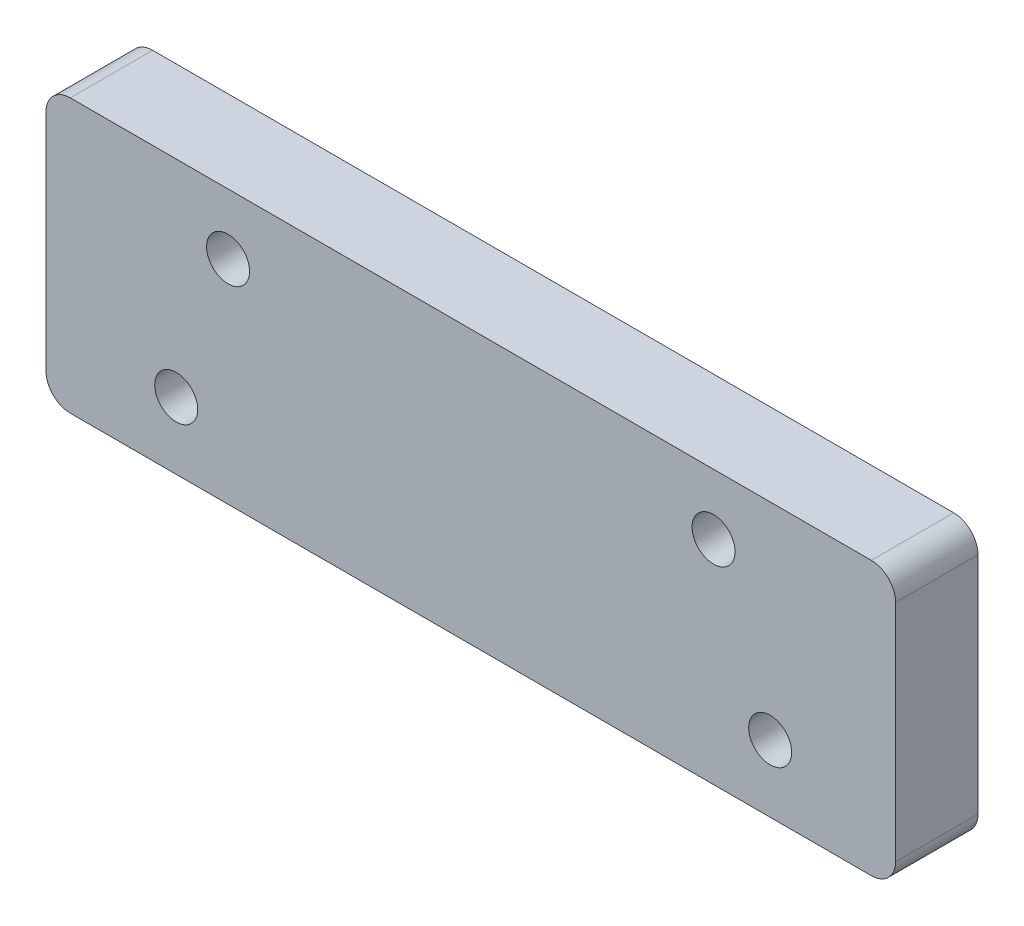
ISO-10303-21;
HEADER;
FILE_DESCRIPTION(('STEP AP214'),'2;1');
FILE_NAME('part.step','',(''),(''),'','','');
FILE_SCHEMA(('AUTOMOTIVE_DESIGN { 1 0 10303 214 1 1 1 1 }'));
ENDSEC;
DATA;
#1=APPLICATION_CONTEXT('core data for automotive mechanical design processes');
#2=APPLICATION_PROTOCOL_DEFINITION('international standard','automotive_design',2000,#1);
#3=PRODUCT_CONTEXT('',#1,'mechanical');
#4=PRODUCT('Part','Part','',(#3));
#5=PRODUCT_RELATED_PRODUCT_CATEGORY('part','',(#4));
#6=PRODUCT_DEFINITION_FORMATION('','',#4);
#7=PRODUCT_DEFINITION_CONTEXT('part definition',#1,'design');
#8=PRODUCT_DEFINITION('design','',#6,#7);
#9=PRODUCT_DEFINITION_SHAPE('','',#8);
#10=(LENGTH_UNIT() NAMED_UNIT(*) SI_UNIT(.MILLI.,.METRE.));
#11=(NAMED_UNIT(*) PLANE_ANGLE_UNIT() SI_UNIT($,.RADIAN.));
#12=(NAMED_UNIT(*) SI_UNIT($,.STERADIAN.) SOLID_ANGLE_UNIT());
#13=UNCERTAINTY_MEASURE_WITH_UNIT(LENGTH_MEASURE(1.E-05),#10,'distance_accuracy_value','');
#14=(GEOMETRIC_REPRESENTATION_CONTEXT(3) GLOBAL_UNCERTAINTY_ASSIGNED_CONTEXT((#13)) GLOBAL_UNIT_ASSIGNED_CONTEXT((#10,
#11,#12)) REPRESENTATION_CONTEXT('',''));
#15=CARTESIAN_POINT('',(0.,0.,0.));
#16=DIRECTION('',(0.,0.,1.));
#17=DIRECTION('',(1.,0.,0.));
#18=AXIS2_PLACEMENT_3D('',#15,#16,#17);
#19=CARTESIAN_POINT('',(17.45,15.875,-7.62));
#20=DIRECTION('',(-1.,0.,0.));
#21=DIRECTION('',(0.,-1.,0.));
#22=AXIS2_PLACEMENT_3D('',#19,#20,#21);
#23=PLANE('',#22);
#24=DIRECTION('',(0.,1.,0.));
#25=VECTOR('',#24,1.);
#26=CARTESIAN_POINT('',(17.45,0.,-8.62));
#27=LINE('',#26,#25);
#28=CARTESIAN_POINT('',(17.45,2.53999999999999,-8.62));
#29=VERTEX_POINT('',#28);
#30=CARTESIAN_POINT('',(17.45,26.035,-8.62));
#31=VERTEX_POINT('',#30);
#32=EDGE_CURVE('E154',#29,#31,#27,.T.);
#33=ORIENTED_EDGE('',*,*,#32,.F.);
#34=DIRECTION('',(0.,0.,1.));
#35=VECTOR('',#34,1.);
#36=CARTESIAN_POINT('',(17.45,2.53999999999999,-7.62));
#37=LINE('',#36,#35);
#38=CARTESIAN_POINT('',(17.45,2.53999999999999,0.));
#39=VERTEX_POINT('',#38);
#40=EDGE_CURVE('E11',#29,#39,#37,.T.);
#41=ORIENTED_EDGE('',*,*,#40,.T.);
#42=DIRECTION('',(0.,-1.,0.));
#43=VECTOR('',#42,1.);
#44=CARTESIAN_POINT('',(17.45,15.875,0.));
#45=LINE('',#44,#43);
#46=CARTESIAN_POINT('',(17.45,26.035,0.));
#47=VERTEX_POINT('',#46);
#48=EDGE_CURVE('E183',#47,#39,#45,.T.);
#49=ORIENTED_EDGE('',*,*,#48,.F.);
#50=DIRECTION('',(0.,0.,1.));
#51=VECTOR('',#50,1.);
#52=CARTESIAN_POINT('',(17.45,26.035,-8.62));
#53=LINE('',#52,#51);
#54=EDGE_CURVE('E44',#47,#31,#53,.F.);
#55=ORIENTED_EDGE('',*,*,#54,.T.);
#56=EDGE_LOOP('',(#33,#41,#49,#55));
#57=FACE_BOUND('',#56,.T.);
#58=ADVANCED_FACE('F36',(#57),#23,.T.);
#59=CARTESIAN_POINT('',(106.35,15.875,-7.62));
#60=DIRECTION('',(1.,0.,0.));
#61=DIRECTION('',(0.,0.,-1.));
#62=AXIS2_PLACEMENT_3D('',#59,#60,#61);
#63=PLANE('',#62);
#64=DIRECTION('',(0.,-1.,0.));
#65=VECTOR('',#64,1.);
#66=CARTESIAN_POINT('',(106.35,15.875,-8.62));
#67=LINE('',#66,#65);
#68=CARTESIAN_POINT('',(106.35,26.035,-8.62));
#69=VERTEX_POINT('',#68);
#70=CARTESIAN_POINT('',(106.35,2.54,-8.62));
#71=VERTEX_POINT('',#70);
#72=EDGE_CURVE('E157',#69,#71,#67,.T.);
#73=ORIENTED_EDGE('',*,*,#72,.F.);
#74=DIRECTION('',(0.,0.,1.));
#75=VECTOR('',#74,1.);
#76=CARTESIAN_POINT('',(106.35,26.035,0.));
#77=LINE('',#76,#75);
#78=CARTESIAN_POINT('',(106.35,26.035,0.));
#79=VERTEX_POINT('',#78);
#80=EDGE_CURVE('E122',#69,#79,#77,.T.);
#81=ORIENTED_EDGE('',*,*,#80,.T.);
#82=DIRECTION('',(0.,1.,0.));
#83=VECTOR('',#82,1.);
#84=CARTESIAN_POINT('',(106.35,15.875,0.));
#85=LINE('',#84,#83);
#86=CARTESIAN_POINT('',(106.35,2.54,0.));
#87=VERTEX_POINT('',#86);
#88=EDGE_CURVE('E105',#87,#79,#85,.T.);
#89=ORIENTED_EDGE('',*,*,#88,.F.);
#90=DIRECTION('',(0.,0.,1.));
#91=VECTOR('',#90,1.);
#92=CARTESIAN_POINT('',(106.35,2.54,-7.62));
#93=LINE('',#92,#91);
#94=EDGE_CURVE('E119',#87,#71,#93,.F.);
#95=ORIENTED_EDGE('',*,*,#94,.T.);
#96=EDGE_LOOP('',(#73,#81,#89,#95));
#97=FACE_BOUND('',#96,.T.);
#98=ADVANCED_FACE('F118',(#97),#63,.T.);
#99=CARTESIAN_POINT('',(106.35,0.,-7.62));
#100=DIRECTION('',(0.,-1.,0.));
#101=DIRECTION('',(1.,0.,0.));
#102=AXIS2_PLACEMENT_3D('',#99,#100,#101);
#103=PLANE('',#102);
#104=DIRECTION('',(-1.,0.,0.));
#105=VECTOR('',#104,1.);
#106=CARTESIAN_POINT('',(106.35,0.,-8.62));
#107=LINE('',#106,#105);
#108=CARTESIAN_POINT('',(103.81,0.,-8.62));
#109=VERTEX_POINT('',#108);
#110=CARTESIAN_POINT('',(19.99,0.,-8.62));
#111=VERTEX_POINT('',#110);
#112=EDGE_CURVE('E153',#109,#111,#107,.T.);
#113=ORIENTED_EDGE('',*,*,#112,.F.);
#114=DIRECTION('',(0.,0.,1.));
#115=VECTOR('',#114,1.);
#116=CARTESIAN_POINT('',(103.81,0.,-7.62));
#117=LINE('',#116,#115);
#118=CARTESIAN_POINT('',(103.81,0.,0.));
#119=VERTEX_POINT('',#118);
#120=EDGE_CURVE('E148',#109,#119,#117,.T.);
#121=ORIENTED_EDGE('',*,*,#120,.T.);
#122=DIRECTION('',(1.,0.,0.));
#123=VECTOR('',#122,1.);
#124=CARTESIAN_POINT('',(106.35,0.,0.));
#125=LINE('',#124,#123);
#126=CARTESIAN_POINT('',(19.99,0.,0.));
#127=VERTEX_POINT('',#126);
#128=EDGE_CURVE('E107',#127,#119,#125,.T.);
#129=ORIENTED_EDGE('',*,*,#128,.F.);
#130=DIRECTION('',(0.,0.,1.));
#131=VECTOR('',#130,1.);
#132=CARTESIAN_POINT('',(19.99,0.,-7.62));
#133=LINE('',#132,#131);
#134=EDGE_CURVE('E146',#127,#111,#133,.F.);
#135=ORIENTED_EDGE('',*,*,#134,.T.);
#136=EDGE_LOOP('',(#113,#121,#129,#135));
#137=FACE_BOUND('',#136,.T.);
#138=ADVANCED_FACE('F151',(#137),#103,.T.);
#139=CARTESIAN_POINT('',(0.,0.,0.));
#140=DIRECTION('',(0.,0.,-1.));
#141=DIRECTION('',(-1.,0.,0.));
#142=AXIS2_PLACEMENT_3D('',#139,#140,#141);
#143=PLANE('',#142);
#144=CARTESIAN_POINT('',(36.5,22.225,0.));
#145=DIRECTION('',(0.,0.,1.));
#146=DIRECTION('',(1.,0.,0.));
#147=AXIS2_PLACEMENT_3D('',#144,#145,#146);
#148=CIRCLE('',#147,2.24999999999999);
#149=CARTESIAN_POINT('',(38.75,22.225,0.));
#150=VERTEX_POINT('',#149);
#151=EDGE_CURVE('E214',#150,#150,#148,.T.);
#152=ORIENTED_EDGE('',*,*,#151,.F.);
#153=EDGE_LOOP('',(#152));
#154=FACE_BOUND('',#153,.T.);
#155=CARTESIAN_POINT('',(87.3,22.225,0.));
#156=DIRECTION('',(0.,0.,1.));
#157=DIRECTION('',(1.,0.,0.));
#158=AXIS2_PLACEMENT_3D('',#155,#156,#157);
#159=CIRCLE('',#158,2.24999999999999);
#160=CARTESIAN_POINT('',(89.55,22.225,0.));
#161=VERTEX_POINT('',#160);
#162=EDGE_CURVE('E208',#161,#161,#159,.T.);
#163=ORIENTED_EDGE('',*,*,#162,.F.);
#164=EDGE_LOOP('',(#163));
#165=FACE_BOUND('',#164,.T.);
#166=CARTESIAN_POINT('',(93.225,6.99999999999999,0.));
#167=DIRECTION('',(0.,0.,-1.));
#168=DIRECTION('',(-1.,0.,0.));
#169=AXIS2_PLACEMENT_3D('',#166,#167,#168);
#170=CIRCLE('',#169,2.25);
#171=CARTESIAN_POINT('',(90.975,6.99999999999999,0.));
#172=VERTEX_POINT('',#171);
#173=EDGE_CURVE('E171',#172,#172,#170,.T.);
#174=ORIENTED_EDGE('',*,*,#173,.T.);
#175=EDGE_LOOP('',(#174));
#176=FACE_BOUND('',#175,.T.);
#177=CARTESIAN_POINT('',(31.0749999999999,7.00000000000008,0.));
#178=DIRECTION('',(0.,0.,-1.));
#179=DIRECTION('',(-1.,0.,0.));
#180=AXIS2_PLACEMENT_3D('',#177,#178,#179);
#181=CIRCLE('',#180,2.25);
#182=CARTESIAN_POINT('',(28.8249999999999,7.00000000000008,0.));
#183=VERTEX_POINT('',#182);
#184=EDGE_CURVE('E180',#183,#183,#181,.T.);
#185=ORIENTED_EDGE('',*,*,#184,.T.);
#186=EDGE_LOOP('',(#185));
#187=FACE_BOUND('',#186,.T.);
#188=ORIENTED_EDGE('',*,*,#88,.T.);
#189=CARTESIAN_POINT('',(103.81,26.035,0.));
#190=DIRECTION('',(0.,0.,-1.));
#191=DIRECTION('',(-1.,0.,0.));
#192=AXIS2_PLACEMENT_3D('',#189,#190,#191);
#193=CIRCLE('',#192,2.54);
#194=CARTESIAN_POINT('',(103.81,28.575,0.));
#195=VERTEX_POINT('',#194);
#196=EDGE_CURVE('E112',#79,#195,#193,.F.);
#197=ORIENTED_EDGE('',*,*,#196,.T.);
#198=DIRECTION('',(1.,0.,0.));
#199=VECTOR('',#198,1.);
#200=CARTESIAN_POINT('',(0.,28.575,0.));
#201=LINE('',#200,#199);
#202=CARTESIAN_POINT('',(19.99,28.575,0.));
#203=VERTEX_POINT('',#202);
#204=EDGE_CURVE('E200',#203,#195,#201,.T.);
#205=ORIENTED_EDGE('',*,*,#204,.F.);
#206=CARTESIAN_POINT('',(19.99,26.035,0.));
#207=DIRECTION('',(0.,0.,-1.));
#208=DIRECTION('',(-1.,0.,0.));
#209=AXIS2_PLACEMENT_3D('',#206,#207,#208);
#210=CIRCLE('',#209,2.54);
#211=EDGE_CURVE('E128',#203,#47,#210,.F.);
#212=ORIENTED_EDGE('',*,*,#211,.T.);
#213=ORIENTED_EDGE('',*,*,#48,.T.);
#214=CARTESIAN_POINT('',(19.99,2.53999999999999,0.));
#215=DIRECTION('',(0.,0.,-1.));
#216=DIRECTION('',(-1.,0.,0.));
#217=AXIS2_PLACEMENT_3D('',#214,#215,#216);
#218=CIRCLE('',#217,2.54);
#219=EDGE_CURVE('E113',#39,#127,#218,.F.);
#220=ORIENTED_EDGE('',*,*,#219,.T.);
#221=ORIENTED_EDGE('',*,*,#128,.T.);
#222=CARTESIAN_POINT('',(103.81,2.54,0.));
#223=DIRECTION('',(0.,0.,-1.));
#224=DIRECTION('',(-1.,0.,0.));
#225=AXIS2_PLACEMENT_3D('',#222,#223,#224);
#226=CIRCLE('',#225,2.54);
#227=EDGE_CURVE('E102',#119,#87,#226,.F.);
#228=ORIENTED_EDGE('',*,*,#227,.T.);
#229=EDGE_LOOP('',(#188,#197,#205,#212,#213,#220,#221,#228));
#230=FACE_BOUND('',#229,.T.);
#231=ADVANCED_FACE('F104',(#154,#165,#176,#187,#230),#143,.F.);
#232=CARTESIAN_POINT('',(31.0749999999999,7.00000000000008,-7.62));
#233=DIRECTION('',(0.,0.,-1.));
#234=DIRECTION('',(-1.,0.,0.));
#235=AXIS2_PLACEMENT_3D('',#232,#233,#234);
#236=CYLINDRICAL_SURFACE('',#235,2.25);
#237=ORIENTED_EDGE('',*,*,#184,.F.);
#238=EDGE_LOOP('',(#237));
#239=FACE_BOUND('',#238,.T.);
#240=CARTESIAN_POINT('',(31.0749999999999,7.00000000000008,-3.62));
#241=DIRECTION('',(0.,0.,-1.));
#242=DIRECTION('',(-1.,0.,0.));
#243=AXIS2_PLACEMENT_3D('',#240,#241,#242);
#244=CIRCLE('',#243,2.25);
#245=CARTESIAN_POINT('',(28.8249999999999,7.00000000000008,-3.62));
#246=VERTEX_POINT('',#245);
#247=EDGE_CURVE('E177',#246,#246,#244,.T.);
#248=ORIENTED_EDGE('',*,*,#247,.T.);
#249=EDGE_LOOP('',(#248));
#250=FACE_BOUND('',#249,.T.);
#251=ADVANCED_FACE('F222',(#239,#250),#236,.F.);
#252=CARTESIAN_POINT('',(33.3249999999999,7.00000000000008,-3.62));
#253=DIRECTION('',(0.,0.,1.));
#254=DIRECTION('',(1.,0.,0.));
#255=AXIS2_PLACEMENT_3D('',#252,#253,#254);
#256=PLANE('',#255);
#257=ORIENTED_EDGE('',*,*,#247,.F.);
#258=EDGE_LOOP('',(#257));
#259=FACE_BOUND('',#258,.T.);
#260=CARTESIAN_POINT('',(31.0749999999999,7.00000000000008,-3.62));
#261=DIRECTION('',(0.,0.,-1.));
#262=DIRECTION('',(-1.,0.,0.));
#263=AXIS2_PLACEMENT_3D('',#260,#261,#262);
#264=CIRCLE('',#263,4.);
#265=CARTESIAN_POINT('',(27.0749999999999,7.00000000000008,-3.62));
#266=VERTEX_POINT('',#265);
#267=EDGE_CURVE('E174',#266,#266,#264,.T.);
#268=ORIENTED_EDGE('',*,*,#267,.T.);
#269=EDGE_LOOP('',(#268));
#270=FACE_BOUND('',#269,.T.);
#271=ADVANCED_FACE('F232',(#259,#270),#256,.F.);
#272=CARTESIAN_POINT('',(31.0749999999999,7.00000000000008,-7.62));
#273=DIRECTION('',(0.,0.,-1.));
#274=DIRECTION('',(-1.,0.,0.));
#275=AXIS2_PLACEMENT_3D('',#272,#273,#274);
#276=CYLINDRICAL_SURFACE('',#275,4.);
#277=ORIENTED_EDGE('',*,*,#267,.F.);
#278=EDGE_LOOP('',(#277));
#279=FACE_BOUND('',#278,.T.);
#280=CARTESIAN_POINT('',(31.0749999999999,7.00000000000008,-8.62));
#281=DIRECTION('',(0.,0.,-1.));
#282=DIRECTION('',(-1.,0.,0.));
#283=AXIS2_PLACEMENT_3D('',#280,#281,#282);
#284=CIRCLE('',#283,4.);
#285=CARTESIAN_POINT('',(27.0749999999999,7.00000000000008,-8.62));
#286=VERTEX_POINT('',#285);
#287=EDGE_CURVE('E155',#286,#286,#284,.T.);
#288=ORIENTED_EDGE('',*,*,#287,.T.);
#289=EDGE_LOOP('',(#288));
#290=FACE_BOUND('',#289,.T.);
#291=ADVANCED_FACE('F238',(#279,#290),#276,.F.);
#292=CARTESIAN_POINT('',(93.225,6.99999999999999,-7.62));
#293=DIRECTION('',(0.,0.,-1.));
#294=DIRECTION('',(-1.,0.,0.));
#295=AXIS2_PLACEMENT_3D('',#292,#293,#294);
#296=CYLINDRICAL_SURFACE('',#295,2.25);
#297=ORIENTED_EDGE('',*,*,#173,.F.);
#298=EDGE_LOOP('',(#297));
#299=FACE_BOUND('',#298,.T.);
#300=CARTESIAN_POINT('',(93.225,6.99999999999999,-3.62));
#301=DIRECTION('',(0.,0.,-1.));
#302=DIRECTION('',(-1.,0.,0.));
#303=AXIS2_PLACEMENT_3D('',#300,#301,#302);
#304=CIRCLE('',#303,2.25);
#305=CARTESIAN_POINT('',(90.975,6.99999999999999,-3.62));
#306=VERTEX_POINT('',#305);
#307=EDGE_CURVE('E168',#306,#306,#304,.T.);
#308=ORIENTED_EDGE('',*,*,#307,.T.);
#309=EDGE_LOOP('',(#308));
#310=FACE_BOUND('',#309,.T.);
#311=ADVANCED_FACE('F244',(#299,#310),#296,.F.);
#312=CARTESIAN_POINT('',(95.475,6.99999999999999,-3.62));
#313=DIRECTION('',(0.,0.,1.));
#314=DIRECTION('',(1.,0.,0.));
#315=AXIS2_PLACEMENT_3D('',#312,#313,#314);
#316=PLANE('',#315);
#317=ORIENTED_EDGE('',*,*,#307,.F.);
#318=EDGE_LOOP('',(#317));
#319=FACE_BOUND('',#318,.T.);
#320=CARTESIAN_POINT('',(93.225,6.99999999999999,-3.62));
#321=DIRECTION('',(0.,0.,-1.));
#322=DIRECTION('',(-1.,0.,0.));
#323=AXIS2_PLACEMENT_3D('',#320,#321,#322);
#324=CIRCLE('',#323,4.);
#325=CARTESIAN_POINT('',(89.225,6.99999999999999,-3.62));
#326=VERTEX_POINT('',#325);
#327=EDGE_CURVE('E165',#326,#326,#324,.T.);
#328=ORIENTED_EDGE('',*,*,#327,.T.);
#329=EDGE_LOOP('',(#328));
#330=FACE_BOUND('',#329,.T.);
#331=ADVANCED_FACE('F258',(#319,#330),#316,.F.);
#332=CARTESIAN_POINT('',(93.225,6.99999999999999,-7.62));
#333=DIRECTION('',(0.,0.,-1.));
#334=DIRECTION('',(-1.,0.,0.));
#335=AXIS2_PLACEMENT_3D('',#332,#333,#334);
#336=CYLINDRICAL_SURFACE('',#335,4.);
#337=ORIENTED_EDGE('',*,*,#327,.F.);
#338=EDGE_LOOP('',(#337));
#339=FACE_BOUND('',#338,.T.);
#340=CARTESIAN_POINT('',(93.225,6.99999999999999,-8.62));
#341=DIRECTION('',(0.,0.,-1.));
#342=DIRECTION('',(-1.,0.,0.));
#343=AXIS2_PLACEMENT_3D('',#340,#341,#342);
#344=CIRCLE('',#343,4.00000000000001);
#345=CARTESIAN_POINT('',(89.225,6.99999999999999,-8.62));
#346=VERTEX_POINT('',#345);
#347=EDGE_CURVE('E160',#346,#346,#344,.T.);
#348=ORIENTED_EDGE('',*,*,#347,.T.);
#349=EDGE_LOOP('',(#348));
#350=FACE_BOUND('',#349,.T.);
#351=ADVANCED_FACE('F249',(#339,#350),#336,.F.);
#352=CARTESIAN_POINT('',(0.,0.,-8.62));
#353=DIRECTION('',(0.,0.,-1.));
#354=DIRECTION('',(-1.,0.,0.));
#355=AXIS2_PLACEMENT_3D('',#352,#353,#354);
#356=PLANE('',#355);
#357=CARTESIAN_POINT('',(36.5,22.225,-8.62));
#358=DIRECTION('',(0.,0.,1.));
#359=DIRECTION('',(1.,0.,0.));
#360=AXIS2_PLACEMENT_3D('',#357,#358,#359);
#361=CIRCLE('',#360,2.25);
#362=CARTESIAN_POINT('',(38.75,22.225,-8.62));
#363=VERTEX_POINT('',#362);
#364=EDGE_CURVE('E211',#363,#363,#361,.T.);
#365=ORIENTED_EDGE('',*,*,#364,.T.);
#366=EDGE_LOOP('',(#365));
#367=FACE_BOUND('',#366,.T.);
#368=CARTESIAN_POINT('',(87.3,22.225,-8.62));
#369=DIRECTION('',(0.,0.,1.));
#370=DIRECTION('',(1.,0.,0.));
#371=AXIS2_PLACEMENT_3D('',#368,#369,#370);
#372=CIRCLE('',#371,2.25);
#373=CARTESIAN_POINT('',(89.55,22.225,-8.62));
#374=VERTEX_POINT('',#373);
#375=EDGE_CURVE('E203',#374,#374,#372,.T.);
#376=ORIENTED_EDGE('',*,*,#375,.T.);
#377=EDGE_LOOP('',(#376));
#378=FACE_BOUND('',#377,.T.);
#379=ORIENTED_EDGE('',*,*,#287,.F.);
#380=EDGE_LOOP('',(#379));
#381=FACE_BOUND('',#380,.T.);
#382=DIRECTION('',(1.,0.,0.));
#383=VECTOR('',#382,1.);
#384=CARTESIAN_POINT('',(0.,28.575,-8.62));
#385=LINE('',#384,#383);
#386=CARTESIAN_POINT('',(19.99,28.575,-8.62));
#387=VERTEX_POINT('',#386);
#388=CARTESIAN_POINT('',(103.81,28.575,-8.62));
#389=VERTEX_POINT('',#388);
#390=EDGE_CURVE('E194',#387,#389,#385,.T.);
#391=ORIENTED_EDGE('',*,*,#390,.T.);
#392=CARTESIAN_POINT('',(103.81,26.035,-8.62));
#393=DIRECTION('',(0.,0.,-1.));
#394=DIRECTION('',(-1.,0.,0.));
#395=AXIS2_PLACEMENT_3D('',#392,#393,#394);
#396=CIRCLE('',#395,2.54);
#397=EDGE_CURVE('E144',#389,#69,#396,.T.);
#398=ORIENTED_EDGE('',*,*,#397,.T.);
#399=ORIENTED_EDGE('',*,*,#72,.T.);
#400=CARTESIAN_POINT('',(103.81,2.54,-8.62));
#401=DIRECTION('',(0.,0.,-1.));
#402=DIRECTION('',(-1.,0.,0.));
#403=AXIS2_PLACEMENT_3D('',#400,#401,#402);
#404=CIRCLE('',#403,2.54);
#405=EDGE_CURVE('E126',#71,#109,#404,.T.);
#406=ORIENTED_EDGE('',*,*,#405,.T.);
#407=ORIENTED_EDGE('',*,*,#112,.T.);
#408=CARTESIAN_POINT('',(19.99,2.53999999999999,-8.62));
#409=DIRECTION('',(0.,0.,-1.));
#410=DIRECTION('',(-1.,0.,0.));
#411=AXIS2_PLACEMENT_3D('',#408,#409,#410);
#412=CIRCLE('',#411,2.54);
#413=EDGE_CURVE('E57',#111,#29,#412,.T.);
#414=ORIENTED_EDGE('',*,*,#413,.T.);
#415=ORIENTED_EDGE('',*,*,#32,.T.);
#416=CARTESIAN_POINT('',(19.99,26.035,-8.62));
#417=DIRECTION('',(0.,0.,-1.));
#418=DIRECTION('',(-1.,0.,0.));
#419=AXIS2_PLACEMENT_3D('',#416,#417,#418);
#420=CIRCLE('',#419,2.54);
#421=EDGE_CURVE('E140',#31,#387,#420,.T.);
#422=ORIENTED_EDGE('',*,*,#421,.T.);
#423=EDGE_LOOP('',(#391,#398,#399,#406,#407,#414,#415,#422));
#424=FACE_BOUND('',#423,.T.);
#425=ORIENTED_EDGE('',*,*,#347,.F.);
#426=EDGE_LOOP('',(#425));
#427=FACE_BOUND('',#426,.T.);
#428=ADVANCED_FACE('F192',(#367,#378,#381,#424,#427),#356,.T.);
#429=CARTESIAN_POINT('',(0.,28.575,-8.62));
#430=DIRECTION('',(0.,-1.,0.));
#431=DIRECTION('',(0.,0.,-1.));
#432=AXIS2_PLACEMENT_3D('',#429,#430,#431);
#433=PLANE('',#432);
#434=ORIENTED_EDGE('',*,*,#204,.T.);
#435=DIRECTION('',(0.,0.,1.));
#436=VECTOR('',#435,1.);
#437=CARTESIAN_POINT('',(103.81,28.575,-8.62));
#438=LINE('',#437,#436);
#439=EDGE_CURVE('E138',#195,#389,#438,.F.);
#440=ORIENTED_EDGE('',*,*,#439,.T.);
#441=ORIENTED_EDGE('',*,*,#390,.F.);
#442=DIRECTION('',(0.,0.,1.));
#443=VECTOR('',#442,1.);
#444=CARTESIAN_POINT('',(19.99,28.575,0.));
#445=LINE('',#444,#443);
#446=EDGE_CURVE('E135',#387,#203,#445,.T.);
#447=ORIENTED_EDGE('',*,*,#446,.T.);
#448=EDGE_LOOP('',(#434,#440,#441,#447));
#449=FACE_BOUND('',#448,.T.);
#450=ADVANCED_FACE('F198',(#449),#433,.F.);
#451=CARTESIAN_POINT('',(87.3,22.225,0.));
#452=DIRECTION('',(0.,0.,1.));
#453=DIRECTION('',(1.,0.,0.));
#454=AXIS2_PLACEMENT_3D('',#451,#452,#453);
#455=CYLINDRICAL_SURFACE('',#454,2.25);
#456=ORIENTED_EDGE('',*,*,#375,.F.);
#457=EDGE_LOOP('',(#456));
#458=FACE_BOUND('',#457,.T.);
#459=ORIENTED_EDGE('',*,*,#162,.T.);
#460=EDGE_LOOP('',(#459));
#461=FACE_BOUND('',#460,.T.);
#462=ADVANCED_FACE('F256',(#458,#461),#455,.F.);
#463=CARTESIAN_POINT('',(36.5,22.225,0.));
#464=DIRECTION('',(0.,0.,1.));
#465=DIRECTION('',(1.,0.,0.));
#466=AXIS2_PLACEMENT_3D('',#463,#464,#465);
#467=CYLINDRICAL_SURFACE('',#466,2.24999999999999);
#468=ORIENTED_EDGE('',*,*,#364,.F.);
#469=EDGE_LOOP('',(#468));
#470=FACE_BOUND('',#469,.T.);
#471=ORIENTED_EDGE('',*,*,#151,.T.);
#472=EDGE_LOOP('',(#471));
#473=FACE_BOUND('',#472,.T.);
#474=ADVANCED_FACE('F218',(#470,#473),#467,.F.);
#475=CARTESIAN_POINT('',(103.81,26.035,-7.62));
#476=DIRECTION('',(0.,0.,-1.));
#477=DIRECTION('',(-1.,0.,0.));
#478=AXIS2_PLACEMENT_3D('',#475,#476,#477);
#479=CYLINDRICAL_SURFACE('',#478,2.54);
#480=ORIENTED_EDGE('',*,*,#397,.F.);
#481=ORIENTED_EDGE('',*,*,#439,.F.);
#482=ORIENTED_EDGE('',*,*,#196,.F.);
#483=ORIENTED_EDGE('',*,*,#80,.F.);
#484=EDGE_LOOP('',(#480,#481,#482,#483));
#485=FACE_BOUND('',#484,.T.);
#486=ADVANCED_FACE('F270',(#485),#479,.T.);
#487=CARTESIAN_POINT('',(103.81,2.54,-7.62));
#488=DIRECTION('',(0.,0.,1.));
#489=DIRECTION('',(1.,0.,0.));
#490=AXIS2_PLACEMENT_3D('',#487,#488,#489);
#491=CYLINDRICAL_SURFACE('',#490,2.54);
#492=ORIENTED_EDGE('',*,*,#405,.F.);
#493=ORIENTED_EDGE('',*,*,#94,.F.);
#494=ORIENTED_EDGE('',*,*,#227,.F.);
#495=ORIENTED_EDGE('',*,*,#120,.F.);
#496=EDGE_LOOP('',(#492,#493,#494,#495));
#497=FACE_BOUND('',#496,.T.);
#498=ADVANCED_FACE('F125',(#497),#491,.T.);
#499=CARTESIAN_POINT('',(19.99,2.53999999999999,-7.62));
#500=DIRECTION('',(0.,0.,1.));
#501=DIRECTION('',(1.,0.,0.));
#502=AXIS2_PLACEMENT_3D('',#499,#500,#501);
#503=CYLINDRICAL_SURFACE('',#502,2.54);
#504=ORIENTED_EDGE('',*,*,#413,.F.);
#505=ORIENTED_EDGE('',*,*,#134,.F.);
#506=ORIENTED_EDGE('',*,*,#219,.F.);
#507=ORIENTED_EDGE('',*,*,#40,.F.);
#508=EDGE_LOOP('',(#504,#505,#506,#507));
#509=FACE_BOUND('',#508,.T.);
#510=ADVANCED_FACE('F275',(#509),#503,.T.);
#511=CARTESIAN_POINT('',(19.99,26.035,-8.62));
#512=DIRECTION('',(0.,0.,-1.));
#513=DIRECTION('',(-1.,0.,0.));
#514=AXIS2_PLACEMENT_3D('',#511,#512,#513);
#515=CYLINDRICAL_SURFACE('',#514,2.54);
#516=ORIENTED_EDGE('',*,*,#421,.F.);
#517=ORIENTED_EDGE('',*,*,#54,.F.);
#518=ORIENTED_EDGE('',*,*,#211,.F.);
#519=ORIENTED_EDGE('',*,*,#446,.F.);
#520=EDGE_LOOP('',(#516,#517,#518,#519));
#521=FACE_BOUND('',#520,.T.);
#522=ADVANCED_FACE('F38',(#521),#515,.T.);
#523=CLOSED_SHELL('',(#58,#98,#138,#231,#251,#271,#291,#311,#331,#351,#428,#450,#462,#474,#486,
#498,#510,#522));
#524=MANIFOLD_SOLID_BREP('B2',#523);
#525=ADVANCED_BREP_SHAPE_REPRESENTATION('',(#18,#524),#14);
#526=SHAPE_DEFINITION_REPRESENTATION(#9,#525);
ENDSEC;
END-ISO-10303-21;
